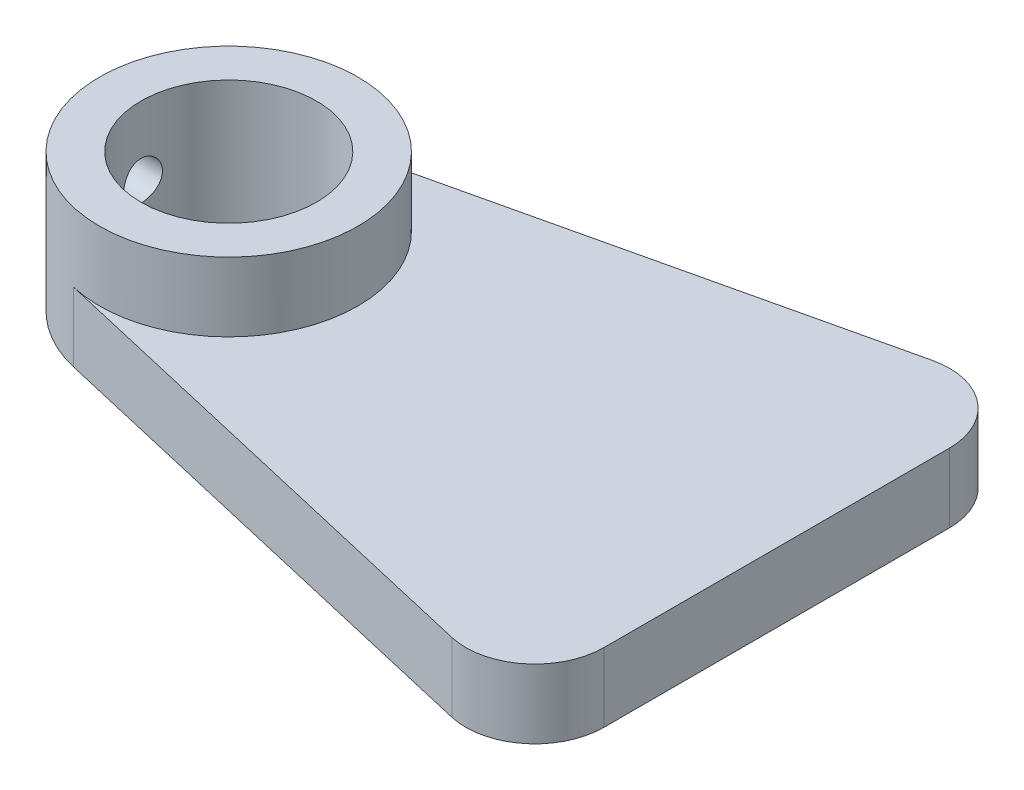
ISO-10303-21;
HEADER;
FILE_DESCRIPTION(('STEP AP214'),'2;1');
FILE_NAME('part.step','',(''),(''),'','','');
FILE_SCHEMA(('AUTOMOTIVE_DESIGN { 1 0 10303 214 1 1 1 1 }'));
ENDSEC;
DATA;
#1=APPLICATION_CONTEXT('core data for automotive mechanical design processes');
#2=APPLICATION_PROTOCOL_DEFINITION('international standard','automotive_design',2000,#1);
#3=PRODUCT_CONTEXT('',#1,'mechanical');
#4=PRODUCT('Part','Part','',(#3));
#5=PRODUCT_RELATED_PRODUCT_CATEGORY('part','',(#4));
#6=PRODUCT_DEFINITION_FORMATION('','',#4);
#7=PRODUCT_DEFINITION_CONTEXT('part definition',#1,'design');
#8=PRODUCT_DEFINITION('design','',#6,#7);
#9=PRODUCT_DEFINITION_SHAPE('','',#8);
#10=(LENGTH_UNIT() NAMED_UNIT(*) SI_UNIT(.MILLI.,.METRE.));
#11=(NAMED_UNIT(*) PLANE_ANGLE_UNIT() SI_UNIT($,.RADIAN.));
#12=(NAMED_UNIT(*) SI_UNIT($,.STERADIAN.) SOLID_ANGLE_UNIT());
#13=UNCERTAINTY_MEASURE_WITH_UNIT(LENGTH_MEASURE(1.E-05),#10,'distance_accuracy_value','');
#14=(GEOMETRIC_REPRESENTATION_CONTEXT(3) GLOBAL_UNCERTAINTY_ASSIGNED_CONTEXT((#13)) GLOBAL_UNIT_ASSIGNED_CONTEXT((#10,
#11,#12)) REPRESENTATION_CONTEXT('',''));
#15=CARTESIAN_POINT('',(0.,0.,0.));
#16=DIRECTION('',(0.,0.,1.));
#17=DIRECTION('',(1.,0.,0.));
#18=AXIS2_PLACEMENT_3D('',#15,#16,#17);
#19=CARTESIAN_POINT('',(0.,5.,0.));
#20=DIRECTION('',(0.,-1.,0.));
#21=DIRECTION('',(0.,0.,-1.));
#22=AXIS2_PLACEMENT_3D('',#19,#20,#21);
#23=CYLINDRICAL_SURFACE('',#22,9.35);
#24=CARTESIAN_POINT('',(-9.35,3.6,0.));
#25=CARTESIAN_POINT('',(-9.34999874871688,3.60000322488676,-0.0781697697484652));
#26=CARTESIAN_POINT('',(-9.34900942942838,3.60656907978243,-0.156384937662956));
#27=CARTESIAN_POINT('',(-9.34515805313962,3.63265243348863,-0.31062915705414));
#28=CARTESIAN_POINT('',(-9.34229417119646,3.65218255366216,-0.386656002758864));
#29=CARTESIAN_POINT('',(-9.3350155144029,3.70359788336311,-0.534269026237014));
#30=CARTESIAN_POINT('',(-9.33060191048971,3.7354737665613,-0.605858508872964));
#31=CARTESIAN_POINT('',(-9.32071154831377,3.81065302156015,-0.742661516835349));
#32=CARTESIAN_POINT('',(-9.31523493813587,3.85395480194808,-0.807875928357151));
#33=CARTESIAN_POINT('',(-9.30377992942692,3.95111589165141,-0.930596282886239));
#34=CARTESIAN_POINT('',(-9.29779830317519,4.00504659708266,-0.988045404331283));
#35=CARTESIAN_POINT('',(-9.28603270151618,4.12178101226572,-1.09311417507362));
#36=CARTESIAN_POINT('',(-9.28024873747778,4.18458523133017,-1.14073325977039));
#37=CARTESIAN_POINT('',(-9.26950200939372,4.31766552271151,-1.22501130345701));
#38=CARTESIAN_POINT('',(-9.26454341639824,4.38797676397296,-1.26161530649952));
#39=CARTESIAN_POINT('',(-9.25605290156957,4.53383588434249,-1.3224729340144));
#40=CARTESIAN_POINT('',(-9.252520902261,4.60938347881386,-1.34672722919268));
#41=CARTESIAN_POINT('',(-9.24731519529666,4.76297329712973,-1.38202052980791));
#42=CARTESIAN_POINT('',(-9.245627817676,4.84099269933156,-1.39315679764552));
#43=CARTESIAN_POINT('',(-9.24426089714928,4.99780968491307,-1.40219923133404));
#44=CARTESIAN_POINT('',(-9.24458123936433,5.07660722351129,-1.40010615414924));
#45=CARTESIAN_POINT('',(-9.24718106388923,5.23205673856489,-1.38282880159643));
#46=CARTESIAN_POINT('',(-9.24944433629545,5.30872106358012,-1.36775283941635));
#47=CARTESIAN_POINT('',(-9.25564968499566,5.45841955397494,-1.32510721504758));
#48=CARTESIAN_POINT('',(-9.25959180862631,5.53145361693132,-1.29753720057693));
#49=CARTESIAN_POINT('',(-9.26872859104725,5.67214804320945,-1.23057338621479));
#50=CARTESIAN_POINT('',(-9.2739280957022,5.73978623637852,-1.19113369396319));
#51=CARTESIAN_POINT('',(-9.28499028001498,5.86752557940347,-1.10158275753212));
#52=CARTESIAN_POINT('',(-9.29085300303396,5.92762623591371,-1.05147081541285));
#53=CARTESIAN_POINT('',(-9.30265266631737,6.03921222015864,-0.941403260378514));
#54=CARTESIAN_POINT('',(-9.30858976393017,6.09060571635497,-0.881354520899215));
#55=CARTESIAN_POINT('',(-9.31981494517203,6.18259951058959,-0.753435372693535));
#56=CARTESIAN_POINT('',(-9.32510302597729,6.22319976166831,-0.685564929938096));
#57=CARTESIAN_POINT('',(-9.33443984701437,6.29245924462512,-0.543849469503863));
#58=CARTESIAN_POINT('',(-9.33848785307956,6.32111140643761,-0.470000945175467));
#59=CARTESIAN_POINT('',(-9.34488227753888,6.36558162333097,-0.318466279206238));
#60=CARTESIAN_POINT('',(-9.34722881055348,6.3814005429373,-0.240780396447381));
#61=CARTESIAN_POINT('',(-9.34994072015745,6.39963315841617,-0.0845688204186976));
#62=CARTESIAN_POINT('',(-9.35032475486863,6.40217310723019,-0.0060581750402724));
#63=CARTESIAN_POINT('',(-9.34911918188856,6.39411077390994,0.150267939257518));
#64=CARTESIAN_POINT('',(-9.34752963507232,6.38350889713461,0.22808342954434));
#65=CARTESIAN_POINT('',(-9.34256704470955,6.34956884396408,0.380428029787219));
#66=CARTESIAN_POINT('',(-9.33920261479644,6.32629216188212,0.454971144400069));
#67=CARTESIAN_POINT('',(-9.3310662904935,6.2677280759464,0.599096692983344));
#68=CARTESIAN_POINT('',(-9.3262943302115,6.23244010978403,0.668678894523988));
#69=CARTESIAN_POINT('',(-9.31582690170958,6.15055884679722,0.801462694338486));
#70=CARTESIAN_POINT('',(-9.31012498918379,6.10388544494589,0.864614378423457));
#71=CARTESIAN_POINT('',(-9.29845240281331,6.00066974573449,0.982233598389389));
#72=CARTESIAN_POINT('',(-9.29248171342227,5.94412687696799,1.03670063111088));
#73=CARTESIAN_POINT('',(-9.28088536352787,5.82221530441306,1.1358636850102));
#74=CARTESIAN_POINT('',(-9.27526296850797,5.7567774115811,1.18047508478979));
#75=CARTESIAN_POINT('',(-9.26505758810144,5.61926268073271,1.25807236489715));
#76=CARTESIAN_POINT('',(-9.26047457471152,5.54718602165325,1.29105855844755));
#77=CARTESIAN_POINT('',(-9.25289048228974,5.39869232235303,1.34433785184353));
#78=CARTESIAN_POINT('',(-9.24988385469927,5.32229156892482,1.36467551966321));
#79=CARTESIAN_POINT('',(-9.24577818693264,5.16711045828071,1.39222231230225));
#80=CARTESIAN_POINT('',(-9.24467901553245,5.08833026513849,1.39943234024328));
#81=CARTESIAN_POINT('',(-9.24451759901034,4.93146998917455,1.40049775932537));
#82=CARTESIAN_POINT('',(-9.24543505980091,4.85339079838786,1.39448620360745));
#83=CARTESIAN_POINT('',(-9.24915943269348,4.69936717511711,1.36956418843293));
#84=CARTESIAN_POINT('',(-9.25196634180998,4.62342273926015,1.35065374935777));
#85=CARTESIAN_POINT('',(-9.25914625789302,4.47586106038163,1.30051775187414));
#86=CARTESIAN_POINT('',(-9.26351808622189,4.40424060801587,1.2693014599788));
#87=CARTESIAN_POINT('',(-9.27333668736396,4.26723205351419,1.19545311421044));
#88=CARTESIAN_POINT('',(-9.27878349631215,4.20184416099252,1.15282067657168));
#89=CARTESIAN_POINT('',(-9.29020359889822,4.07848080836084,1.05686670983585));
#90=CARTESIAN_POINT('',(-9.2961814389745,4.02058241387143,1.00344663100054));
#91=CARTESIAN_POINT('',(-9.30795207199957,3.91452444181267,0.88764202440313));
#92=CARTESIAN_POINT('',(-9.31374482160707,3.86636713137199,0.825255415547024));
#93=CARTESIAN_POINT('',(-9.3245288563622,3.78092255748261,0.692886342071508));
#94=CARTESIAN_POINT('',(-9.32951557266851,3.7436963457288,0.62286410282344));
#95=CARTESIAN_POINT('',(-9.33808084969406,3.68158888130135,0.477519402167572));
#96=CARTESIAN_POINT('',(-9.34166086885329,3.65669483582278,0.402202526201557));
#97=CARTESIAN_POINT('',(-9.34619167419596,3.62560934983679,0.272122755840347));
#98=CARTESIAN_POINT('',(-9.34761246593871,3.61602051092222,0.218162979153408));
#99=CARTESIAN_POINT('',(-9.34951706124275,3.60321474604359,0.109476218593726));
#100=CARTESIAN_POINT('',(-9.35000087638489,3.5999977413249,0.0547492442118158));
#101=CARTESIAN_POINT('',(-9.35,3.6,0.));
#102=B_SPLINE_CURVE_WITH_KNOTS('',3,(#24,#25,#26,#27,#28,#29,#30,#31,#32,#33,#34,#35,#36,#37,
#38,#39,#40,#41,#42,#43,#44,#45,#46,#47,#48,#49,#50,#51,#52,#53,#54,#55,#56,#57,#58,#59,#60,#61,
#62,#63,#64,#65,#66,#67,#68,#69,#70,#71,#72,#73,#74,#75,#76,#77,#78,#79,#80,#81,#82,#83,#84,#85,
#86,#87,#88,#89,#90,#91,#92,#93,#94,#95,#96,#97,#98,#99,#100,#101),.UNSPECIFIED.,.T.,.F.,(4,2,2,
2,2,2,2,2,2,2,2,2,2,2,2,2,2,2,2,2,2,2,2,2,2,2,2,2,2,2,2,2,2,2,2,2,2,2,4),(0.,0.234309250370285,
0.468846947765941,0.703207813421613,0.93753605422797,1.17349553318355,1.40946856100014,
1.6466000867985,1.88371873273856,2.11906799154291,2.35440378411946,2.5877950381366,
2.82119287325667,3.05550495979368,3.28983237449298,3.52649514169865,3.76315893856687,
3.99996257891291,4.23675026539642,4.47128248832785,4.70580747730482,4.93920463078247,
5.17261271225813,5.40771292022306,5.64282674415729,5.87988694156806,6.11694075128182,
6.35315448121235,6.58935196010304,6.82318339162325,7.05701445366881,7.29066977232527,
7.52433294653691,7.76023605526973,7.9961940048076,8.23344578341158,8.47045093018296,
8.63456057216558,8.79866818577234),.UNSPECIFIED.);
#103=CARTESIAN_POINT('',(-9.35,3.6,0.));
#104=VERTEX_POINT('',#103);
#105=EDGE_CURVE('E208',#104,#104,#102,.T.);
#106=ORIENTED_EDGE('',*,*,#105,.T.);
#107=EDGE_LOOP('',(#106));
#108=FACE_BOUND('',#107,.T.);
#109=CARTESIAN_POINT('',(0.,0.,0.));
#110=DIRECTION('',(0.,1.,0.));
#111=DIRECTION('',(0.,0.,1.));
#112=AXIS2_PLACEMENT_3D('',#109,#110,#111);
#113=CIRCLE('',#112,9.35);
#114=CARTESIAN_POINT('',(-2.11202709967258,0.,-9.10833912029239));
#115=VERTEX_POINT('',#114);
#116=CARTESIAN_POINT('',(-2.11202709967258,0.,9.10833912029239));
#117=VERTEX_POINT('',#116);
#118=EDGE_CURVE('E150',#115,#117,#113,.T.);
#119=ORIENTED_EDGE('',*,*,#118,.T.);
#120=DIRECTION('',(0.,-1.,0.));
#121=VECTOR('',#120,1.);
#122=CARTESIAN_POINT('',(-2.11202709967258,5.,9.10833912029239));
#123=LINE('',#122,#121);
#124=CARTESIAN_POINT('',(-2.11202709967258,5.,9.10833912029239));
#125=VERTEX_POINT('',#124);
#126=EDGE_CURVE('E11',#125,#117,#123,.T.);
#127=ORIENTED_EDGE('',*,*,#126,.F.);
#128=CARTESIAN_POINT('',(0.,5.,0.));
#129=DIRECTION('',(0.,1.,0.));
#130=DIRECTION('',(0.,0.,1.));
#131=AXIS2_PLACEMENT_3D('',#128,#129,#130);
#132=CIRCLE('',#131,9.35);
#133=CARTESIAN_POINT('',(-2.11202709967258,5.,-9.10833912029239));
#134=VERTEX_POINT('',#133);
#135=EDGE_CURVE('E107',#134,#125,#132,.F.);
#136=ORIENTED_EDGE('',*,*,#135,.F.);
#137=DIRECTION('',(0.,-1.,0.));
#138=VECTOR('',#137,1.);
#139=CARTESIAN_POINT('',(-2.11202709967258,5.,-9.10833912029239));
#140=LINE('',#139,#138);
#141=EDGE_CURVE('E101',#134,#115,#140,.T.);
#142=ORIENTED_EDGE('',*,*,#141,.T.);
#143=EDGE_LOOP('',(#119,#127,#136,#142));
#144=FACE_BOUND('',#143,.T.);
#145=CARTESIAN_POINT('',(0.,10.,0.));
#146=DIRECTION('',(0.,1.,0.));
#147=DIRECTION('',(0.,0.,1.));
#148=AXIS2_PLACEMENT_3D('',#145,#146,#147);
#149=CIRCLE('',#148,9.35);
#150=CARTESIAN_POINT('',(0.,10.,9.35));
#151=VERTEX_POINT('',#150);
#152=EDGE_CURVE('E187',#151,#151,#149,.T.);
#153=ORIENTED_EDGE('',*,*,#152,.F.);
#154=EDGE_LOOP('',(#153));
#155=FACE_BOUND('',#154,.T.);
#156=ADVANCED_FACE('F45',(#108,#144,#155),#23,.T.);
#157=CARTESIAN_POINT('',(-2.11202709967258,5.,9.10833912029239));
#158=DIRECTION('',(0.22588525130188,0.,-0.974153916608811));
#159=DIRECTION('',(-0.974153916608811,0.,-0.22588525130188));
#160=AXIS2_PLACEMENT_3D('',#157,#158,#159);
#161=PLANE('',#160);
#162=DIRECTION('',(0.974153916608811,0.,0.22588525130188));
#163=VECTOR('',#162,1.);
#164=CARTESIAN_POINT('',(-2.11202709967258,0.,9.10833912029239));
#165=LINE('',#164,#163);
#166=CARTESIAN_POINT('',(33.5205737434906,0.,17.3707695830441));
#167=VERTEX_POINT('',#166);
#168=EDGE_CURVE('E153',#117,#167,#165,.T.);
#169=ORIENTED_EDGE('',*,*,#168,.T.);
#170=DIRECTION('',(0.,-1.,0.));
#171=VECTOR('',#170,1.);
#172=CARTESIAN_POINT('',(33.5205737434906,5.,17.3707695830441));
#173=LINE('',#172,#171);
#174=CARTESIAN_POINT('',(33.5205737434906,5.,17.3707695830441));
#175=VERTEX_POINT('',#174);
#176=EDGE_CURVE('E61',#175,#167,#173,.T.);
#177=ORIENTED_EDGE('',*,*,#176,.F.);
#178=DIRECTION('',(0.974153916608811,0.,0.22588525130188));
#179=VECTOR('',#178,1.);
#180=CARTESIAN_POINT('',(-2.11202709967258,5.,9.10833912029239));
#181=LINE('',#180,#179);
#182=EDGE_CURVE('E118',#125,#175,#181,.T.);
#183=ORIENTED_EDGE('',*,*,#182,.F.);
#184=ORIENTED_EDGE('',*,*,#126,.T.);
#185=EDGE_LOOP('',(#169,#177,#183,#184));
#186=FACE_BOUND('',#185,.T.);
#187=ADVANCED_FACE('F237',(#186),#161,.F.);
#188=CARTESIAN_POINT('',(34.65,5.,12.5));
#189=DIRECTION('',(0.,-1.,0.));
#190=DIRECTION('',(0.,0.,-1.));
#191=AXIS2_PLACEMENT_3D('',#188,#189,#190);
#192=CYLINDRICAL_SURFACE('',#191,5.);
#193=CARTESIAN_POINT('',(34.65,0.,12.5));
#194=DIRECTION('',(0.,1.,0.));
#195=DIRECTION('',(0.,0.,1.));
#196=AXIS2_PLACEMENT_3D('',#193,#194,#195);
#197=CIRCLE('',#196,5.);
#198=CARTESIAN_POINT('',(39.65,0.,12.5));
#199=VERTEX_POINT('',#198);
#200=EDGE_CURVE('E128',#167,#199,#197,.T.);
#201=ORIENTED_EDGE('',*,*,#200,.T.);
#202=DIRECTION('',(0.,-1.,0.));
#203=VECTOR('',#202,1.);
#204=CARTESIAN_POINT('',(39.65,5.,12.5));
#205=LINE('',#204,#203);
#206=CARTESIAN_POINT('',(39.65,5.,12.5));
#207=VERTEX_POINT('',#206);
#208=EDGE_CURVE('E125',#207,#199,#205,.T.);
#209=ORIENTED_EDGE('',*,*,#208,.F.);
#210=CARTESIAN_POINT('',(34.65,5.,12.5));
#211=DIRECTION('',(0.,1.,0.));
#212=DIRECTION('',(0.,0.,1.));
#213=AXIS2_PLACEMENT_3D('',#210,#211,#212);
#214=CIRCLE('',#213,5.);
#215=EDGE_CURVE('E113',#175,#207,#214,.T.);
#216=ORIENTED_EDGE('',*,*,#215,.F.);
#217=ORIENTED_EDGE('',*,*,#176,.T.);
#218=EDGE_LOOP('',(#201,#209,#216,#217));
#219=FACE_BOUND('',#218,.T.);
#220=ADVANCED_FACE('F126',(#219),#192,.T.);
#221=CARTESIAN_POINT('',(39.65,5.,0.));
#222=DIRECTION('',(1.,0.,0.));
#223=DIRECTION('',(0.,0.,-1.));
#224=AXIS2_PLACEMENT_3D('',#221,#222,#223);
#225=PLANE('',#224);
#226=DIRECTION('',(0.,0.,1.));
#227=VECTOR('',#226,1.);
#228=CARTESIAN_POINT('',(39.65,0.,0.));
#229=LINE('',#228,#227);
#230=CARTESIAN_POINT('',(39.65,0.,-12.5));
#231=VERTEX_POINT('',#230);
#232=EDGE_CURVE('E158',#231,#199,#229,.T.);
#233=ORIENTED_EDGE('',*,*,#232,.F.);
#234=DIRECTION('',(0.,-1.,0.));
#235=VECTOR('',#234,1.);
#236=CARTESIAN_POINT('',(39.65,5.,-12.5));
#237=LINE('',#236,#235);
#238=CARTESIAN_POINT('',(39.65,5.,-12.5));
#239=VERTEX_POINT('',#238);
#240=EDGE_CURVE('E133',#239,#231,#237,.T.);
#241=ORIENTED_EDGE('',*,*,#240,.F.);
#242=DIRECTION('',(0.,0.,1.));
#243=VECTOR('',#242,1.);
#244=CARTESIAN_POINT('',(39.65,5.,0.));
#245=LINE('',#244,#243);
#246=EDGE_CURVE('E117',#239,#207,#245,.T.);
#247=ORIENTED_EDGE('',*,*,#246,.T.);
#248=ORIENTED_EDGE('',*,*,#208,.T.);
#249=EDGE_LOOP('',(#233,#241,#247,#248));
#250=FACE_BOUND('',#249,.T.);
#251=ADVANCED_FACE('F135',(#250),#225,.T.);
#252=CARTESIAN_POINT('',(34.65,5.,-12.5));
#253=DIRECTION('',(0.,-1.,0.));
#254=DIRECTION('',(0.,0.,-1.));
#255=AXIS2_PLACEMENT_3D('',#252,#253,#254);
#256=CYLINDRICAL_SURFACE('',#255,5.);
#257=CARTESIAN_POINT('',(34.65,0.,-12.5));
#258=DIRECTION('',(0.,1.,0.));
#259=DIRECTION('',(0.,0.,1.));
#260=AXIS2_PLACEMENT_3D('',#257,#258,#259);
#261=CIRCLE('',#260,5.);
#262=CARTESIAN_POINT('',(33.5205737434906,0.,-17.3707695830441));
#263=VERTEX_POINT('',#262);
#264=EDGE_CURVE('E161',#231,#263,#261,.T.);
#265=ORIENTED_EDGE('',*,*,#264,.T.);
#266=DIRECTION('',(0.,-1.,0.));
#267=VECTOR('',#266,1.);
#268=CARTESIAN_POINT('',(33.5205737434906,5.,-17.3707695830441));
#269=LINE('',#268,#267);
#270=CARTESIAN_POINT('',(33.5205737434906,5.,-17.3707695830441));
#271=VERTEX_POINT('',#270);
#272=EDGE_CURVE('E93',#271,#263,#269,.T.);
#273=ORIENTED_EDGE('',*,*,#272,.F.);
#274=CARTESIAN_POINT('',(34.65,5.,-12.5));
#275=DIRECTION('',(0.,1.,0.));
#276=DIRECTION('',(0.,0.,1.));
#277=AXIS2_PLACEMENT_3D('',#274,#275,#276);
#278=CIRCLE('',#277,5.);
#279=EDGE_CURVE('E69',#239,#271,#278,.T.);
#280=ORIENTED_EDGE('',*,*,#279,.F.);
#281=ORIENTED_EDGE('',*,*,#240,.T.);
#282=EDGE_LOOP('',(#265,#273,#280,#281));
#283=FACE_BOUND('',#282,.T.);
#284=ADVANCED_FACE('F182',(#283),#256,.T.);
#285=CARTESIAN_POINT('',(0.,5.,0.));
#286=DIRECTION('',(0.,-1.,0.));
#287=DIRECTION('',(0.,0.,-1.));
#288=AXIS2_PLACEMENT_3D('',#285,#286,#287);
#289=CYLINDRICAL_SURFACE('',#288,6.35);
#290=CARTESIAN_POINT('',(-6.19374684661877,5.,-1.4));
#291=CARTESIAN_POINT('',(-6.19374841494423,5.07760622942105,-1.39999735223189));
#292=CARTESIAN_POINT('',(-6.19522131779223,5.15524414254004,-1.39352512949226));
#293=CARTESIAN_POINT('',(-6.20094273842287,5.30831095445648,-1.36783625256079));
#294=CARTESIAN_POINT('',(-6.20519324211269,5.38373823236533,-1.34861047978735));
#295=CARTESIAN_POINT('',(-6.21596560433523,5.5301474752009,-1.29805023179138));
#296=CARTESIAN_POINT('',(-6.2224849469684,5.60113426171786,-1.26672916475525));
#297=CARTESIAN_POINT('',(-6.23705738832785,5.73684750344382,-1.19290592932587));
#298=CARTESIAN_POINT('',(-6.24511046064515,5.80157406641738,-1.15040395344957));
#299=CARTESIAN_POINT('',(-6.2619973953809,5.92404117588797,-1.05464784534151));
#300=CARTESIAN_POINT('',(-6.27084138082884,5.98165864000593,-1.00123805492983));
#301=CARTESIAN_POINT('',(-6.2882250668152,6.08719370736385,-0.885518411834659));
#302=CARTESIAN_POINT('',(-6.29676474342176,6.13511054909564,-0.823207861087311));
#303=CARTESIAN_POINT('',(-6.31268795729434,6.2203719346031,-0.690629297263067));
#304=CARTESIAN_POINT('',(-6.32005815700129,6.25759796268659,-0.620283326908143));
#305=CARTESIAN_POINT('',(-6.33269758841189,6.31965405262247,-0.474144400272669));
#306=CARTESIAN_POINT('',(-6.3379670597027,6.3444855281495,-0.398352066311804));
#307=CARTESIAN_POINT('',(-6.34573977080403,6.3806601510627,-0.244751836659834));
#308=CARTESIAN_POINT('',(-6.3482856947264,6.39221164748807,-0.166995206027449));
#309=CARTESIAN_POINT('',(-6.35047238691971,6.40214996399966,-0.0106088045723574));
#310=CARTESIAN_POINT('',(-6.35011349265103,6.40053831328321,0.0680208637674266));
#311=CARTESIAN_POINT('',(-6.34656356304481,6.38435097906154,0.222484578589357));
#312=CARTESIAN_POINT('',(-6.34342159403537,6.36999988574625,0.298343455263481));
#313=CARTESIAN_POINT('',(-6.33471451939126,6.32909909532836,0.446548946664486));
#314=CARTESIAN_POINT('',(-6.3291493030494,6.30254884089829,0.518895400756828));
#315=CARTESIAN_POINT('',(-6.31614234547206,6.2378056355902,0.658644181524316));
#316=CARTESIAN_POINT('',(-6.30868699813534,6.19952782860063,0.726005877583422));
#317=CARTESIAN_POINT('',(-6.29271679259167,6.11247941498844,0.853431524176358));
#318=CARTESIAN_POINT('',(-6.28420178796139,6.06370735759123,0.913494463897509));
#319=CARTESIAN_POINT('',(-6.26683573288302,5.95583313961061,1.02595360230183));
#320=CARTESIAN_POINT('',(-6.25798138369601,5.89653442535151,1.07816091914626));
#321=CARTESIAN_POINT('',(-6.24110298088458,5.76993188087404,1.17192575701002));
#322=CARTESIAN_POINT('',(-6.2330789505059,5.70262782665019,1.21348297991568));
#323=CARTESIAN_POINT('',(-6.21876080641967,5.56161634678097,1.2848538108177));
#324=CARTESIAN_POINT('',(-6.21247204365773,5.48789001675927,1.31463121382326));
#325=CARTESIAN_POINT('',(-6.20241026801494,5.33630825976777,1.36131669331642));
#326=CARTESIAN_POINT('',(-6.19863684898606,5.25845350160056,1.37822684751796));
#327=CARTESIAN_POINT('',(-6.19411596879859,5.10255215311493,1.39840377218717));
#328=CARTESIAN_POINT('',(-6.19330746995889,5.02454291420888,1.40194579255794));
#329=CARTESIAN_POINT('',(-6.19464324002806,4.86904857846131,1.3960315536116));
#330=CARTESIAN_POINT('',(-6.19678730257543,4.79156344536916,1.38657620271156));
#331=CARTESIAN_POINT('',(-6.20372892921873,4.6402785628264,1.35517457684555));
#332=CARTESIAN_POINT('',(-6.20849417210478,4.56644563190014,1.33338035592029));
#333=CARTESIAN_POINT('',(-6.22011199894049,4.4234794457706,1.27808449193225));
#334=CARTESIAN_POINT('',(-6.22696478530388,4.35434664710001,1.24458171353045));
#335=CARTESIAN_POINT('',(-6.24211937097206,4.22155330991487,1.1662149393382));
#336=CARTESIAN_POINT('',(-6.25044213289103,4.15799512163937,1.12118164709335));
#337=CARTESIAN_POINT('',(-6.26754382728552,4.03923686802175,1.02125329970387));
#338=CARTESIAN_POINT('',(-6.27632281726411,3.98403785972067,0.966356999270834));
#339=CARTESIAN_POINT('',(-6.29354929883296,3.88249404361341,0.847014446272044));
#340=CARTESIAN_POINT('',(-6.30198734405535,3.83633704135586,0.782406801560421));
#341=CARTESIAN_POINT('',(-6.31740633059219,3.75553158482297,0.64619506268429));
#342=CARTESIAN_POINT('',(-6.32438734052437,3.72088258854341,0.574591298228756));
#343=CARTESIAN_POINT('',(-6.33606590841665,3.66433702920784,0.426869549746665));
#344=CARTESIAN_POINT('',(-6.34077802846514,3.64235895735325,0.350783969661727));
#345=CARTESIAN_POINT('',(-6.34745089628105,3.61152501357343,0.19588481074989));
#346=CARTESIAN_POINT('',(-6.34941205077818,3.60266720180953,0.117071636963134));
#347=CARTESIAN_POINT('',(-6.35034970286836,3.59841360492631,-0.0392636373199488));
#348=CARTESIAN_POINT('',(-6.34938832913177,3.6027375994612,-0.116777873137778));
#349=CARTESIAN_POINT('',(-6.34472230294462,3.62409728839434,-0.269945879421722));
#350=CARTESIAN_POINT('',(-6.34101770135135,3.64113274713209,-0.345599684351898));
#351=CARTESIAN_POINT('',(-6.33128634026787,3.68729659968654,-0.492678492945368));
#352=CARTESIAN_POINT('',(-6.32526732955764,3.71638466560184,-0.56411669977335));
#353=CARTESIAN_POINT('',(-6.31154938761597,3.78578893109656,-0.701135551472126));
#354=CARTESIAN_POINT('',(-6.30385029052955,3.82610623931434,-0.766715617136797));
#355=CARTESIAN_POINT('',(-6.28742649821327,3.91773514192107,-0.891521538570716));
#356=CARTESIAN_POINT('',(-6.27868491271979,3.96924344265934,-0.950600768246307));
#357=CARTESIAN_POINT('',(-6.26125152381091,4.08139619327862,-1.05937290605848));
#358=CARTESIAN_POINT('',(-6.25255973293082,4.14204284706165,-1.10906354340917));
#359=CARTESIAN_POINT('',(-6.23607780755743,4.27174524060313,-1.19830138622969));
#360=CARTESIAN_POINT('',(-6.22830158174108,4.34090435536275,-1.23770106125685));
#361=CARTESIAN_POINT('',(-6.21470669330077,4.48501944549934,-1.30425588040803));
#362=CARTESIAN_POINT('',(-6.20888638685208,4.55997048763556,-1.331421313193));
#363=CARTESIAN_POINT('',(-6.20092985880705,4.69582328112183,-1.36792817581107));
#364=CARTESIAN_POINT('',(-6.19825422743617,4.75599217994225,-1.37993188689902));
#365=CARTESIAN_POINT('',(-6.19466214626395,4.87743416851129,-1.3959686441057));
#366=CARTESIAN_POINT('',(-6.19374560796751,4.93870720255738,-1.4000020911867));
#367=CARTESIAN_POINT('',(-6.19374684661877,5.,-1.4));
#368=B_SPLINE_CURVE_WITH_KNOTS('',3,(#290,#291,#292,#293,#294,#295,#296,#297,#298,#299,#300,
#301,#302,#303,#304,#305,#306,#307,#308,#309,#310,#311,#312,#313,#314,#315,#316,#317,#318,#319,
#320,#321,#322,#323,#324,#325,#326,#327,#328,#329,#330,#331,#332,#333,#334,#335,#336,#337,#338,
#339,#340,#341,#342,#343,#344,#345,#346,#347,#348,#349,#350,#351,#352,#353,#354,#355,#356,#357,
#358,#359,#360,#361,#362,#363,#364,#365,#366,#367),.UNSPECIFIED.,.T.,.F.,(4,2,2,2,2,2,2,2,2,2,2,
2,2,2,2,2,2,2,2,2,2,2,2,2,2,2,2,2,2,2,2,2,2,2,2,2,2,2,4),(0.,0.232594032140486,
0.465354544746923,0.697857768967264,0.930356990124686,1.16644050945121,1.40254255438031,
1.64116897964311,1.87976818187777,2.11457060783881,2.3493457565743,2.58006235941637,
2.8107895037609,3.04322718856403,3.27569702731594,3.51308047735243,3.75047057141742,
3.98858471277401,4.22666039694928,4.45980648540864,4.69293627956413,4.92325382682848,
5.15359371340173,5.3875316964558,5.62149923694706,5.85990465872548,6.09829885048917,
6.33514189282524,6.5719499142727,6.80375920266095,7.03556419359478,7.26659975176259,
7.49765812765244,7.73316453445793,7.96872782965853,8.20750275591751,8.44607650234499,
8.62978670520664,8.81348766587311),.UNSPECIFIED.);
#369=CARTESIAN_POINT('',(-6.19374684661877,5.,-1.4));
#370=VERTEX_POINT('',#369);
#371=EDGE_CURVE('E50',#370,#370,#368,.T.);
#372=ORIENTED_EDGE('',*,*,#371,.F.);
#373=EDGE_LOOP('',(#372));
#374=FACE_BOUND('',#373,.T.);
#375=CARTESIAN_POINT('',(0.,0.,0.));
#376=DIRECTION('',(0.,1.,0.));
#377=DIRECTION('',(0.,0.,1.));
#378=AXIS2_PLACEMENT_3D('',#375,#376,#377);
#379=CIRCLE('',#378,6.35);
#380=CARTESIAN_POINT('',(0.,0.,6.35));
#381=VERTEX_POINT('',#380);
#382=EDGE_CURVE('E146',#381,#381,#379,.T.);
#383=ORIENTED_EDGE('',*,*,#382,.F.);
#384=EDGE_LOOP('',(#383));
#385=FACE_BOUND('',#384,.T.);
#386=CARTESIAN_POINT('',(0.,10.,0.));
#387=DIRECTION('',(0.,1.,0.));
#388=DIRECTION('',(0.,0.,1.));
#389=AXIS2_PLACEMENT_3D('',#386,#387,#388);
#390=CIRCLE('',#389,6.35);
#391=CARTESIAN_POINT('',(0.,10.,6.35));
#392=VERTEX_POINT('',#391);
#393=EDGE_CURVE('E192',#392,#392,#390,.T.);
#394=ORIENTED_EDGE('',*,*,#393,.T.);
#395=EDGE_LOOP('',(#394));
#396=FACE_BOUND('',#395,.T.);
#397=ADVANCED_FACE('F47',(#374,#385,#396),#289,.F.);
#398=CARTESIAN_POINT('',(-2.11202709967258,5.,-9.10833912029239));
#399=DIRECTION('',(-0.22588525130188,0.,-0.974153916608811));
#400=DIRECTION('',(-0.974153916608811,0.,0.22588525130188));
#401=AXIS2_PLACEMENT_3D('',#398,#399,#400);
#402=PLANE('',#401);
#403=DIRECTION('',(0.974153916608811,0.,-0.22588525130188));
#404=VECTOR('',#403,1.);
#405=CARTESIAN_POINT('',(-2.11202709967258,0.,-9.10833912029239));
#406=LINE('',#405,#404);
#407=EDGE_CURVE('E164',#115,#263,#406,.T.);
#408=ORIENTED_EDGE('',*,*,#407,.F.);
#409=ORIENTED_EDGE('',*,*,#141,.F.);
#410=DIRECTION('',(0.974153916608811,0.,-0.22588525130188));
#411=VECTOR('',#410,1.);
#412=CARTESIAN_POINT('',(-2.11202709967258,5.,-9.10833912029239));
#413=LINE('',#412,#411);
#414=EDGE_CURVE('E140',#134,#271,#413,.T.);
#415=ORIENTED_EDGE('',*,*,#414,.T.);
#416=ORIENTED_EDGE('',*,*,#272,.T.);
#417=EDGE_LOOP('',(#408,#409,#415,#416));
#418=FACE_BOUND('',#417,.T.);
#419=ADVANCED_FACE('F183',(#418),#402,.T.);
#420=CARTESIAN_POINT('',(0.,5.,0.));
#421=DIRECTION('',(0.,1.,0.));
#422=DIRECTION('',(0.,0.,1.));
#423=AXIS2_PLACEMENT_3D('',#420,#421,#422);
#424=PLANE('',#423);
#425=ORIENTED_EDGE('',*,*,#414,.F.);
#426=ORIENTED_EDGE('',*,*,#135,.T.);
#427=ORIENTED_EDGE('',*,*,#182,.T.);
#428=ORIENTED_EDGE('',*,*,#215,.T.);
#429=ORIENTED_EDGE('',*,*,#246,.F.);
#430=ORIENTED_EDGE('',*,*,#279,.T.);
#431=EDGE_LOOP('',(#425,#426,#427,#428,#429,#430));
#432=FACE_BOUND('',#431,.T.);
#433=ADVANCED_FACE('F115',(#432),#424,.T.);
#434=CARTESIAN_POINT('',(0.,0.,0.));
#435=DIRECTION('',(0.,1.,0.));
#436=DIRECTION('',(0.,0.,1.));
#437=AXIS2_PLACEMENT_3D('',#434,#435,#436);
#438=PLANE('',#437);
#439=ORIENTED_EDGE('',*,*,#168,.F.);
#440=ORIENTED_EDGE('',*,*,#118,.F.);
#441=ORIENTED_EDGE('',*,*,#407,.T.);
#442=ORIENTED_EDGE('',*,*,#264,.F.);
#443=ORIENTED_EDGE('',*,*,#232,.T.);
#444=ORIENTED_EDGE('',*,*,#200,.F.);
#445=EDGE_LOOP('',(#439,#440,#441,#442,#443,#444));
#446=FACE_BOUND('',#445,.T.);
#447=ORIENTED_EDGE('',*,*,#382,.T.);
#448=EDGE_LOOP('',(#447));
#449=FACE_BOUND('',#448,.T.);
#450=ADVANCED_FACE('F178',(#446,#449),#438,.F.);
#451=CARTESIAN_POINT('',(0.,10.,0.));
#452=DIRECTION('',(0.,1.,0.));
#453=DIRECTION('',(0.,0.,1.));
#454=AXIS2_PLACEMENT_3D('',#451,#452,#453);
#455=PLANE('',#454);
#456=ORIENTED_EDGE('',*,*,#393,.F.);
#457=EDGE_LOOP('',(#456));
#458=FACE_BOUND('',#457,.T.);
#459=ORIENTED_EDGE('',*,*,#152,.T.);
#460=EDGE_LOOP('',(#459));
#461=FACE_BOUND('',#460,.T.);
#462=ADVANCED_FACE('F220',(#458,#461),#455,.T.);
#463=CARTESIAN_POINT('',(-9.35,5.,0.));
#464=DIRECTION('',(1.,0.,0.));
#465=DIRECTION('',(0.,0.,-1.));
#466=AXIS2_PLACEMENT_3D('',#463,#464,#465);
#467=CYLINDRICAL_SURFACE('',#466,1.4);
#468=ORIENTED_EDGE('',*,*,#371,.T.);
#469=EDGE_LOOP('',(#468));
#470=FACE_BOUND('',#469,.T.);
#471=ORIENTED_EDGE('',*,*,#105,.F.);
#472=EDGE_LOOP('',(#471));
#473=FACE_BOUND('',#472,.T.);
#474=ADVANCED_FACE('F216',(#470,#473),#467,.F.);
#475=CLOSED_SHELL('',(#156,#187,#220,#251,#284,#397,#419,#433,#450,#462,#474));
#476=MANIFOLD_SOLID_BREP('B2',#475);
#477=ADVANCED_BREP_SHAPE_REPRESENTATION('',(#18,#476),#14);
#478=SHAPE_DEFINITION_REPRESENTATION(#9,#477);
ENDSEC;
END-ISO-10303-21;
